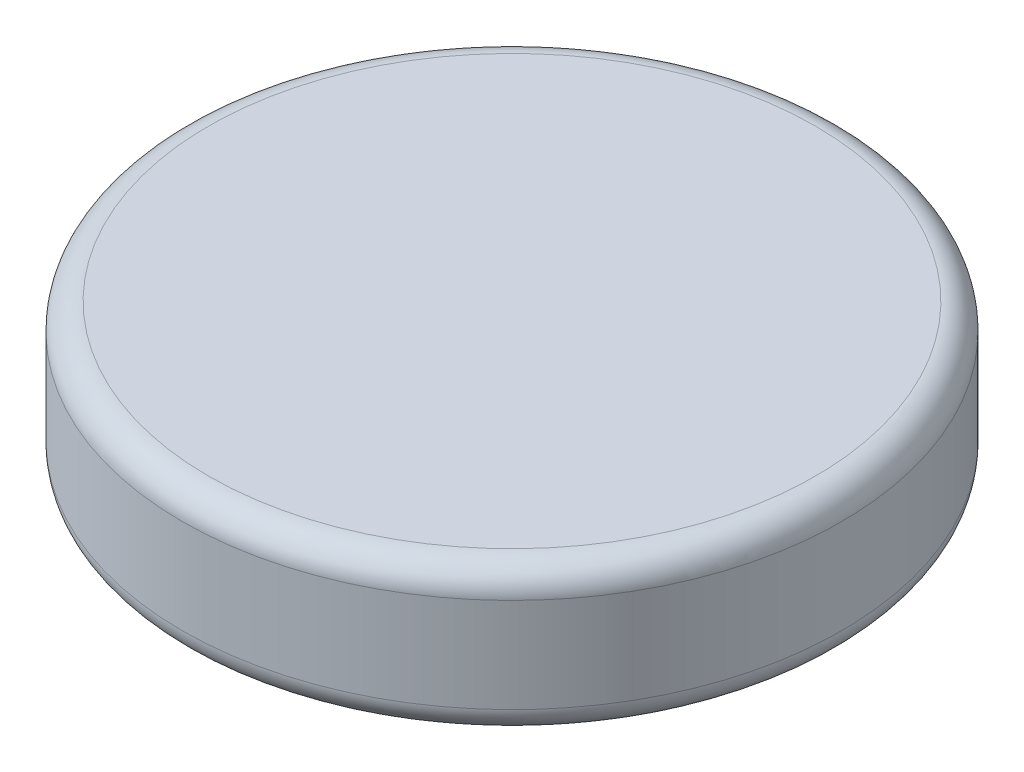
ISO-10303-21;
HEADER;
FILE_DESCRIPTION(('STEP AP214'),'2;1');
FILE_NAME('part.step','',(''),(''),'','','');
FILE_SCHEMA(('AUTOMOTIVE_DESIGN { 1 0 10303 214 1 1 1 1 }'));
ENDSEC;
DATA;
#1=APPLICATION_CONTEXT('core data for automotive mechanical design processes');
#2=APPLICATION_PROTOCOL_DEFINITION('international standard','automotive_design',2000,#1);
#3=PRODUCT_CONTEXT('',#1,'mechanical');
#4=PRODUCT('Part','Part','',(#3));
#5=PRODUCT_RELATED_PRODUCT_CATEGORY('part','',(#4));
#6=PRODUCT_DEFINITION_FORMATION('','',#4);
#7=PRODUCT_DEFINITION_CONTEXT('part definition',#1,'design');
#8=PRODUCT_DEFINITION('design','',#6,#7);
#9=PRODUCT_DEFINITION_SHAPE('','',#8);
#10=(LENGTH_UNIT() NAMED_UNIT(*) SI_UNIT(.MILLI.,.METRE.));
#11=(NAMED_UNIT(*) PLANE_ANGLE_UNIT() SI_UNIT($,.RADIAN.));
#12=(NAMED_UNIT(*) SI_UNIT($,.STERADIAN.) SOLID_ANGLE_UNIT());
#13=UNCERTAINTY_MEASURE_WITH_UNIT(LENGTH_MEASURE(1.E-05),#10,'distance_accuracy_value','');
#14=(GEOMETRIC_REPRESENTATION_CONTEXT(3) GLOBAL_UNCERTAINTY_ASSIGNED_CONTEXT((#13)) GLOBAL_UNIT_ASSIGNED_CONTEXT((#10,
#11,#12)) REPRESENTATION_CONTEXT('',''));
#15=CARTESIAN_POINT('',(0.,0.,0.));
#16=DIRECTION('',(0.,0.,1.));
#17=DIRECTION('',(1.,0.,0.));
#18=AXIS2_PLACEMENT_3D('',#15,#16,#17);
#19=CARTESIAN_POINT('',(0.,7.112,0.));
#20=DIRECTION('',(0.,-1.,0.));
#21=DIRECTION('',(0.,0.,-1.));
#22=AXIS2_PLACEMENT_3D('',#19,#20,#21);
#23=CYLINDRICAL_SURFACE('',#22,15.9385);
#24=CARTESIAN_POINT('',(0.,1.27,0.));
#25=DIRECTION('',(0.,1.,0.));
#26=DIRECTION('',(0.,0.,1.));
#27=AXIS2_PLACEMENT_3D('',#24,#25,#26);
#28=CIRCLE('',#27,15.9385);
#29=CARTESIAN_POINT('',(0.,1.27,15.9385));
#30=VERTEX_POINT('',#29);
#31=EDGE_CURVE('E56',#30,#30,#28,.T.);
#32=ORIENTED_EDGE('',*,*,#31,.T.);
#33=EDGE_LOOP('',(#32));
#34=FACE_BOUND('',#33,.T.);
#35=CARTESIAN_POINT('',(0.,5.842,0.));
#36=DIRECTION('',(0.,1.,0.));
#37=DIRECTION('',(0.,0.,1.));
#38=AXIS2_PLACEMENT_3D('',#35,#36,#37);
#39=CIRCLE('',#38,15.9385);
#40=CARTESIAN_POINT('',(0.,5.842,15.9385));
#41=VERTEX_POINT('',#40);
#42=EDGE_CURVE('E61',#41,#41,#39,.F.);
#43=ORIENTED_EDGE('',*,*,#42,.T.);
#44=EDGE_LOOP('',(#43));
#45=FACE_BOUND('',#44,.T.);
#46=ADVANCED_FACE('F43',(#34,#45),#23,.T.);
#47=CARTESIAN_POINT('',(0.,7.112,0.));
#48=DIRECTION('',(0.,1.,0.));
#49=DIRECTION('',(0.,0.,1.));
#50=AXIS2_PLACEMENT_3D('',#47,#48,#49);
#51=PLANE('',#50);
#52=CARTESIAN_POINT('',(0.,7.112,0.));
#53=DIRECTION('',(0.,1.,0.));
#54=DIRECTION('',(0.,0.,1.));
#55=AXIS2_PLACEMENT_3D('',#52,#53,#54);
#56=CIRCLE('',#55,14.6685);
#57=CARTESIAN_POINT('',(0.,7.112,14.6685));
#58=VERTEX_POINT('',#57);
#59=EDGE_CURVE('E10',#58,#58,#56,.T.);
#60=ORIENTED_EDGE('',*,*,#59,.T.);
#61=EDGE_LOOP('',(#60));
#62=FACE_BOUND('',#61,.T.);
#63=ADVANCED_FACE('F78',(#62),#51,.T.);
#64=CARTESIAN_POINT('',(0.,0.,0.));
#65=DIRECTION('',(0.,1.,0.));
#66=DIRECTION('',(0.,0.,1.));
#67=AXIS2_PLACEMENT_3D('',#64,#65,#66);
#68=PLANE('',#67);
#69=CARTESIAN_POINT('',(0.,0.,0.));
#70=DIRECTION('',(0.,1.,0.));
#71=DIRECTION('',(0.,0.,1.));
#72=AXIS2_PLACEMENT_3D('',#69,#70,#71);
#73=CIRCLE('',#72,14.6685);
#74=CARTESIAN_POINT('',(0.,0.,14.6685));
#75=VERTEX_POINT('',#74);
#76=EDGE_CURVE('E51',#75,#75,#73,.F.);
#77=ORIENTED_EDGE('',*,*,#76,.T.);
#78=EDGE_LOOP('',(#77));
#79=FACE_BOUND('',#78,.T.);
#80=ADVANCED_FACE('F75',(#79),#68,.F.);
#81=CARTESIAN_POINT('',(0.,1.27,0.));
#82=DIRECTION('',(0.,1.,0.));
#83=DIRECTION('',(0.,0.,1.));
#84=AXIS2_PLACEMENT_3D('',#81,#82,#83);
#85=TOROIDAL_SURFACE('',#84,14.6685,1.27);
#86=ORIENTED_EDGE('',*,*,#76,.F.);
#87=EDGE_LOOP('',(#86));
#88=FACE_BOUND('',#87,.T.);
#89=ORIENTED_EDGE('',*,*,#31,.F.);
#90=EDGE_LOOP('',(#89));
#91=FACE_BOUND('',#90,.T.);
#92=ADVANCED_FACE('F71',(#88,#91),#85,.T.);
#93=CARTESIAN_POINT('',(0.,5.842,0.));
#94=DIRECTION('',(0.,1.,0.));
#95=DIRECTION('',(0.,0.,1.));
#96=AXIS2_PLACEMENT_3D('',#93,#94,#95);
#97=TOROIDAL_SURFACE('',#96,14.6685,1.27);
#98=ORIENTED_EDGE('',*,*,#42,.F.);
#99=EDGE_LOOP('',(#98));
#100=FACE_BOUND('',#99,.T.);
#101=ORIENTED_EDGE('',*,*,#59,.F.);
#102=EDGE_LOOP('',(#101));
#103=FACE_BOUND('',#102,.T.);
#104=ADVANCED_FACE('F45',(#100,#103),#97,.T.);
#105=CLOSED_SHELL('',(#46,#63,#80,#92,#104));
#106=MANIFOLD_SOLID_BREP('B2',#105);
#107=ADVANCED_BREP_SHAPE_REPRESENTATION('',(#18,#106),#14);
#108=SHAPE_DEFINITION_REPRESENTATION(#9,#107);
ENDSEC;
END-ISO-10303-21;
